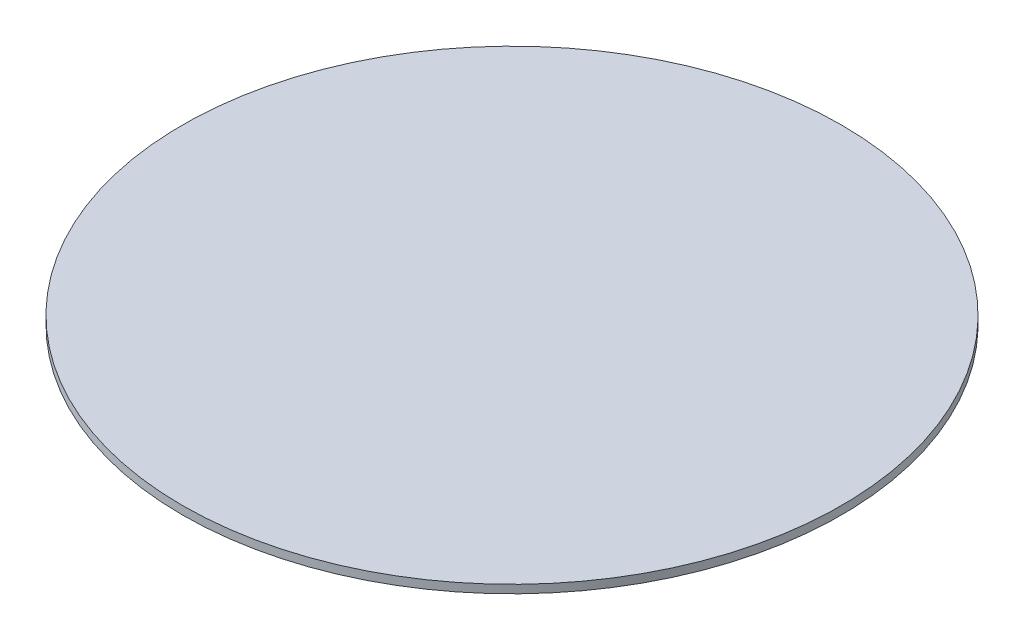
ISO-10303-21;
HEADER;
FILE_DESCRIPTION(('STEP AP214'),'2;1');
FILE_NAME('part.step','',(''),(''),'','','');
FILE_SCHEMA(('AUTOMOTIVE_DESIGN { 1 0 10303 214 1 1 1 1 }'));
ENDSEC;
DATA;
#1=APPLICATION_CONTEXT('core data for automotive mechanical design processes');
#2=APPLICATION_PROTOCOL_DEFINITION('international standard','automotive_design',2000,#1);
#3=PRODUCT_CONTEXT('',#1,'mechanical');
#4=PRODUCT('Part','Part','',(#3));
#5=PRODUCT_RELATED_PRODUCT_CATEGORY('part','',(#4));
#6=PRODUCT_DEFINITION_FORMATION('','',#4);
#7=PRODUCT_DEFINITION_CONTEXT('part definition',#1,'design');
#8=PRODUCT_DEFINITION('design','',#6,#7);
#9=PRODUCT_DEFINITION_SHAPE('','',#8);
#10=(LENGTH_UNIT() NAMED_UNIT(*) SI_UNIT(.MILLI.,.METRE.));
#11=(NAMED_UNIT(*) PLANE_ANGLE_UNIT() SI_UNIT($,.RADIAN.));
#12=(NAMED_UNIT(*) SI_UNIT($,.STERADIAN.) SOLID_ANGLE_UNIT());
#13=UNCERTAINTY_MEASURE_WITH_UNIT(LENGTH_MEASURE(1.E-05),#10,'distance_accuracy_value','');
#14=(GEOMETRIC_REPRESENTATION_CONTEXT(3) GLOBAL_UNCERTAINTY_ASSIGNED_CONTEXT((#13)) GLOBAL_UNIT_ASSIGNED_CONTEXT((#10,
#11,#12)) REPRESENTATION_CONTEXT('',''));
#15=CARTESIAN_POINT('',(0.,0.,0.));
#16=DIRECTION('',(0.,0.,1.));
#17=DIRECTION('',(1.,0.,0.));
#18=AXIS2_PLACEMENT_3D('',#15,#16,#17);
#19=CARTESIAN_POINT('',(0.,0.396875,0.));
#20=DIRECTION('',(0.,-1.,0.));
#21=DIRECTION('',(0.,0.,-1.));
#22=AXIS2_PLACEMENT_3D('',#19,#20,#21);
#23=CYLINDRICAL_SURFACE('',#22,15.875);
#24=CARTESIAN_POINT('',(0.,0.396875,0.));
#25=DIRECTION('',(0.,1.,0.));
#26=DIRECTION('',(0.,0.,1.));
#27=AXIS2_PLACEMENT_3D('',#24,#25,#26);
#28=CIRCLE('',#27,15.875);
#29=CARTESIAN_POINT('',(0.,0.396875,15.875));
#30=VERTEX_POINT('',#29);
#31=EDGE_CURVE('E10',#30,#30,#28,.T.);
#32=ORIENTED_EDGE('',*,*,#31,.F.);
#33=EDGE_LOOP('',(#32));
#34=FACE_BOUND('',#33,.T.);
#35=CARTESIAN_POINT('',(0.,0.,0.));
#36=DIRECTION('',(0.,1.,0.));
#37=DIRECTION('',(0.,0.,1.));
#38=AXIS2_PLACEMENT_3D('',#35,#36,#37);
#39=CIRCLE('',#38,15.875);
#40=CARTESIAN_POINT('',(0.,0.,15.875));
#41=VERTEX_POINT('',#40);
#42=EDGE_CURVE('E34',#41,#41,#39,.T.);
#43=ORIENTED_EDGE('',*,*,#42,.T.);
#44=EDGE_LOOP('',(#43));
#45=FACE_BOUND('',#44,.T.);
#46=ADVANCED_FACE('F31',(#34,#45),#23,.T.);
#47=CARTESIAN_POINT('',(0.,0.396875,0.));
#48=DIRECTION('',(0.,1.,0.));
#49=DIRECTION('',(0.,0.,1.));
#50=AXIS2_PLACEMENT_3D('',#47,#48,#49);
#51=PLANE('',#50);
#52=ORIENTED_EDGE('',*,*,#31,.T.);
#53=EDGE_LOOP('',(#52));
#54=FACE_BOUND('',#53,.T.);
#55=ADVANCED_FACE('F46',(#54),#51,.T.);
#56=CARTESIAN_POINT('',(0.,0.,0.));
#57=DIRECTION('',(0.,1.,0.));
#58=DIRECTION('',(0.,0.,1.));
#59=AXIS2_PLACEMENT_3D('',#56,#57,#58);
#60=PLANE('',#59);
#61=ORIENTED_EDGE('',*,*,#42,.F.);
#62=EDGE_LOOP('',(#61));
#63=FACE_BOUND('',#62,.T.);
#64=ADVANCED_FACE('F44',(#63),#60,.F.);
#65=CLOSED_SHELL('',(#46,#55,#64));
#66=MANIFOLD_SOLID_BREP('B2',#65);
#67=ADVANCED_BREP_SHAPE_REPRESENTATION('',(#18,#66),#14);
#68=SHAPE_DEFINITION_REPRESENTATION(#9,#67);
ENDSEC;
END-ISO-10303-21;
